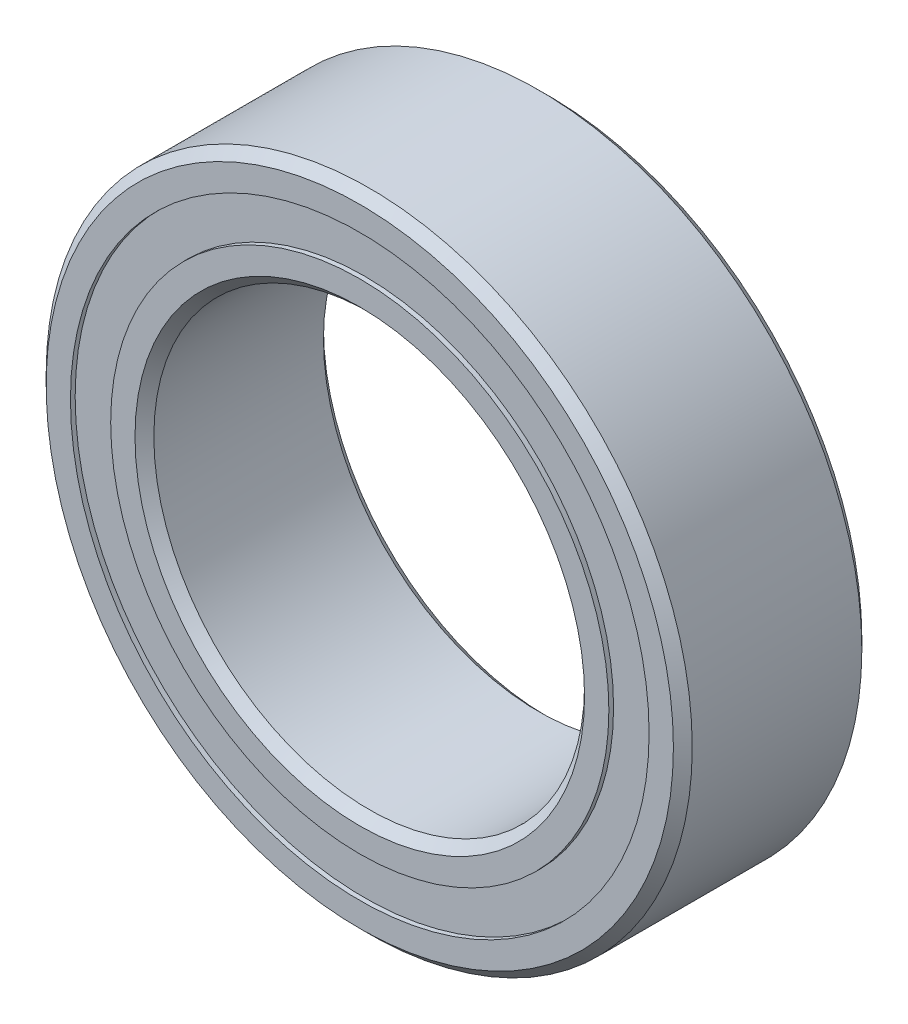
ISO-10303-21;
HEADER;
FILE_DESCRIPTION(('STEP AP214'),'2;1');
FILE_NAME('part.step','',(''),(''),'','','');
FILE_SCHEMA(('AUTOMOTIVE_DESIGN { 1 0 10303 214 1 1 1 1 }'));
ENDSEC;
DATA;
#1=APPLICATION_CONTEXT('core data for automotive mechanical design processes');
#2=APPLICATION_PROTOCOL_DEFINITION('international standard','automotive_design',2000,#1);
#3=PRODUCT_CONTEXT('',#1,'mechanical');
#4=PRODUCT('Part','Part','',(#3));
#5=PRODUCT_RELATED_PRODUCT_CATEGORY('part','',(#4));
#6=PRODUCT_DEFINITION_FORMATION('','',#4);
#7=PRODUCT_DEFINITION_CONTEXT('part definition',#1,'design');
#8=PRODUCT_DEFINITION('design','',#6,#7);
#9=PRODUCT_DEFINITION_SHAPE('','',#8);
#10=(LENGTH_UNIT() NAMED_UNIT(*) SI_UNIT(.MILLI.,.METRE.));
#11=(NAMED_UNIT(*) PLANE_ANGLE_UNIT() SI_UNIT($,.RADIAN.));
#12=(NAMED_UNIT(*) SI_UNIT($,.STERADIAN.) SOLID_ANGLE_UNIT());
#13=UNCERTAINTY_MEASURE_WITH_UNIT(LENGTH_MEASURE(1.E-05),#10,'distance_accuracy_value','');
#14=(GEOMETRIC_REPRESENTATION_CONTEXT(3) GLOBAL_UNCERTAINTY_ASSIGNED_CONTEXT((#13)) GLOBAL_UNIT_ASSIGNED_CONTEXT((#10,
#11,#12)) REPRESENTATION_CONTEXT('',''));
#15=CARTESIAN_POINT('',(0.,0.,0.));
#16=DIRECTION('',(0.,0.,1.));
#17=DIRECTION('',(1.,0.,0.));
#18=AXIS2_PLACEMENT_3D('',#15,#16,#17);
#19=CARTESIAN_POINT('',(0.,5.37362637362637,-1.6625));
#20=DIRECTION('',(0.,0.,1.));
#21=DIRECTION('',(1.,0.,0.));
#22=AXIS2_PLACEMENT_3D('',#19,#20,#21);
#23=PLANE('',#22);
#24=CARTESIAN_POINT('',(0.,0.,-1.6625));
#25=DIRECTION('',(0.,0.,1.));
#26=DIRECTION('',(1.,0.,0.));
#27=AXIS2_PLACEMENT_3D('',#24,#25,#26);
#28=CIRCLE('',#27,5.37362637362637);
#29=CARTESIAN_POINT('',(5.37362637362637,0.,-1.6625));
#30=VERTEX_POINT('',#29);
#31=EDGE_CURVE('E55',#30,#30,#28,.T.);
#32=ORIENTED_EDGE('',*,*,#31,.F.);
#33=EDGE_LOOP('',(#32));
#34=FACE_BOUND('',#33,.T.);
#35=CARTESIAN_POINT('',(0.,0.,-1.6625));
#36=DIRECTION('',(0.,0.,1.));
#37=DIRECTION('',(1.,0.,0.));
#38=AXIS2_PLACEMENT_3D('',#35,#36,#37);
#39=CIRCLE('',#38,4.62637362637363);
#40=CARTESIAN_POINT('',(4.62637362637363,0.,-1.6625));
#41=VERTEX_POINT('',#40);
#42=EDGE_CURVE('E11',#41,#41,#39,.T.);
#43=ORIENTED_EDGE('',*,*,#42,.T.);
#44=EDGE_LOOP('',(#43));
#45=FACE_BOUND('',#44,.T.);
#46=ADVANCED_FACE('F41',(#34,#45),#23,.F.);
#47=CARTESIAN_POINT('',(0.,0.,1.75));
#48=DIRECTION('',(0.,0.,1.));
#49=DIRECTION('',(1.,0.,0.));
#50=AXIS2_PLACEMENT_3D('',#47,#48,#49);
#51=CYLINDRICAL_SURFACE('',#50,4.62637362637363);
#52=ORIENTED_EDGE('',*,*,#42,.F.);
#53=EDGE_LOOP('',(#52));
#54=FACE_BOUND('',#53,.T.);
#55=CARTESIAN_POINT('',(0.,0.,-0.862864380232568));
#56=DIRECTION('',(0.,0.,1.));
#57=DIRECTION('',(1.,0.,0.));
#58=AXIS2_PLACEMENT_3D('',#55,#56,#57);
#59=CIRCLE('',#58,4.62637362637363);
#60=CARTESIAN_POINT('',(4.62637362637363,0.,-0.862864380232568));
#61=VERTEX_POINT('',#60);
#62=EDGE_CURVE('E47',#61,#61,#59,.T.);
#63=ORIENTED_EDGE('',*,*,#62,.T.);
#64=EDGE_LOOP('',(#63));
#65=FACE_BOUND('',#64,.T.);
#66=ADVANCED_FACE('F64',(#54,#65),#51,.F.);
#67=CARTESIAN_POINT('',(0.,5.37362637362637,-0.862864380232568));
#68=DIRECTION('',(0.,0.,-1.));
#69=DIRECTION('',(-1.,0.,0.));
#70=AXIS2_PLACEMENT_3D('',#67,#68,#69);
#71=PLANE('',#70);
#72=ORIENTED_EDGE('',*,*,#62,.F.);
#73=EDGE_LOOP('',(#72));
#74=FACE_BOUND('',#73,.T.);
#75=CARTESIAN_POINT('',(0.,0.,-0.862864380232568));
#76=DIRECTION('',(0.,0.,1.));
#77=DIRECTION('',(1.,0.,0.));
#78=AXIS2_PLACEMENT_3D('',#75,#76,#77);
#79=CIRCLE('',#78,5.37362637362637);
#80=CARTESIAN_POINT('',(5.37362637362637,0.,-0.862864380232568));
#81=VERTEX_POINT('',#80);
#82=EDGE_CURVE('E51',#81,#81,#79,.T.);
#83=ORIENTED_EDGE('',*,*,#82,.T.);
#84=EDGE_LOOP('',(#83));
#85=FACE_BOUND('',#84,.T.);
#86=ADVANCED_FACE('F68',(#74,#85),#71,.F.);
#87=CARTESIAN_POINT('',(0.,0.,1.75));
#88=DIRECTION('',(0.,0.,1.));
#89=DIRECTION('',(1.,0.,0.));
#90=AXIS2_PLACEMENT_3D('',#87,#88,#89);
#91=CYLINDRICAL_SURFACE('',#90,5.37362637362637);
#92=ORIENTED_EDGE('',*,*,#82,.F.);
#93=EDGE_LOOP('',(#92));
#94=FACE_BOUND('',#93,.T.);
#95=ORIENTED_EDGE('',*,*,#31,.T.);
#96=EDGE_LOOP('',(#95));
#97=FACE_BOUND('',#96,.T.);
#98=ADVANCED_FACE('F61',(#94,#97),#91,.T.);
#99=CLOSED_SHELL('',(#46,#66,#86,#98));
#100=MANIFOLD_SOLID_BREP('B2',#99);
#101=CARTESIAN_POINT('',(0.,5.37362637362637,1.6625));
#102=DIRECTION('',(0.,0.,-1.));
#103=DIRECTION('',(-1.,0.,0.));
#104=AXIS2_PLACEMENT_3D('',#101,#102,#103);
#105=PLANE('',#104);
#106=CARTESIAN_POINT('',(0.,0.,1.6625));
#107=DIRECTION('',(0.,0.,1.));
#108=DIRECTION('',(1.,0.,0.));
#109=AXIS2_PLACEMENT_3D('',#106,#107,#108);
#110=CIRCLE('',#109,4.62637362637363);
#111=CARTESIAN_POINT('',(4.62637362637363,0.,1.6625));
#112=VERTEX_POINT('',#111);
#113=EDGE_CURVE('E40',#112,#112,#110,.T.);
#114=ORIENTED_EDGE('',*,*,#113,.F.);
#115=EDGE_LOOP('',(#114));
#116=FACE_BOUND('',#115,.T.);
#117=CARTESIAN_POINT('',(0.,0.,1.6625));
#118=DIRECTION('',(0.,0.,1.));
#119=DIRECTION('',(1.,0.,0.));
#120=AXIS2_PLACEMENT_3D('',#117,#118,#119);
#121=CIRCLE('',#120,5.37362637362637);
#122=CARTESIAN_POINT('',(5.37362637362637,0.,1.6625));
#123=VERTEX_POINT('',#122);
#124=EDGE_CURVE('E122',#123,#123,#121,.T.);
#125=ORIENTED_EDGE('',*,*,#124,.T.);
#126=EDGE_LOOP('',(#125));
#127=FACE_BOUND('',#126,.T.);
#128=ADVANCED_FACE('F108',(#116,#127),#105,.F.);
#129=CARTESIAN_POINT('',(0.,0.,1.75));
#130=DIRECTION('',(0.,0.,1.));
#131=DIRECTION('',(1.,0.,0.));
#132=AXIS2_PLACEMENT_3D('',#129,#130,#131);
#133=CYLINDRICAL_SURFACE('',#132,4.62637362637363);
#134=CARTESIAN_POINT('',(0.,0.,0.862864380232567));
#135=DIRECTION('',(0.,0.,1.));
#136=DIRECTION('',(1.,0.,0.));
#137=AXIS2_PLACEMENT_3D('',#134,#135,#136);
#138=CIRCLE('',#137,4.62637362637363);
#139=CARTESIAN_POINT('',(4.62637362637363,0.,0.862864380232567));
#140=VERTEX_POINT('',#139);
#141=EDGE_CURVE('E114',#140,#140,#138,.T.);
#142=ORIENTED_EDGE('',*,*,#141,.F.);
#143=EDGE_LOOP('',(#142));
#144=FACE_BOUND('',#143,.T.);
#145=ORIENTED_EDGE('',*,*,#113,.T.);
#146=EDGE_LOOP('',(#145));
#147=FACE_BOUND('',#146,.T.);
#148=ADVANCED_FACE('F137',(#144,#147),#133,.F.);
#149=CARTESIAN_POINT('',(0.,5.37362637362637,0.862864380232567));
#150=DIRECTION('',(0.,0.,1.));
#151=DIRECTION('',(1.,0.,0.));
#152=AXIS2_PLACEMENT_3D('',#149,#150,#151);
#153=PLANE('',#152);
#154=CARTESIAN_POINT('',(0.,0.,0.862864380232567));
#155=DIRECTION('',(0.,0.,1.));
#156=DIRECTION('',(1.,0.,0.));
#157=AXIS2_PLACEMENT_3D('',#154,#155,#156);
#158=CIRCLE('',#157,5.37362637362637);
#159=CARTESIAN_POINT('',(5.37362637362637,0.,0.862864380232567));
#160=VERTEX_POINT('',#159);
#161=EDGE_CURVE('E118',#160,#160,#158,.T.);
#162=ORIENTED_EDGE('',*,*,#161,.F.);
#163=EDGE_LOOP('',(#162));
#164=FACE_BOUND('',#163,.T.);
#165=ORIENTED_EDGE('',*,*,#141,.T.);
#166=EDGE_LOOP('',(#165));
#167=FACE_BOUND('',#166,.T.);
#168=ADVANCED_FACE('F132',(#164,#167),#153,.F.);
#169=CARTESIAN_POINT('',(0.,0.,1.75));
#170=DIRECTION('',(0.,0.,1.));
#171=DIRECTION('',(1.,0.,0.));
#172=AXIS2_PLACEMENT_3D('',#169,#170,#171);
#173=CYLINDRICAL_SURFACE('',#172,5.37362637362637);
#174=ORIENTED_EDGE('',*,*,#124,.F.);
#175=EDGE_LOOP('',(#174));
#176=FACE_BOUND('',#175,.T.);
#177=ORIENTED_EDGE('',*,*,#161,.T.);
#178=EDGE_LOOP('',(#177));
#179=FACE_BOUND('',#178,.T.);
#180=ADVANCED_FACE('F129',(#176,#179),#173,.T.);
#181=CLOSED_SHELL('',(#128,#148,#168,#180));
#182=MANIFOLD_SOLID_BREP('B6',#181);
#183=CARTESIAN_POINT('',(-2.49999999999994,4.33012701892223,0.));
#184=DIRECTION('',(0.,0.,1.));
#185=DIRECTION('',(0.499999999999989,-0.866025403784445,0.));
#186=AXIS2_PLACEMENT_3D('',#183,#184,#185);
#187=SPHERICAL_SURFACE('',#186,0.862864380232568);
#188=CARTESIAN_POINT('',(-2.49999999999994,4.33012701892223,0.862864380232567));
#189=VERTEX_POINT('',#188);
#190=VERTEX_LOOP('',#189);
#191=FACE_BOUND('',#190,.T.);
#192=ADVANCED_FACE('F175',(#191),#187,.T.);
#193=CLOSED_SHELL('',(#192));
#194=MANIFOLD_SOLID_BREP('B35',#193);
#195=CARTESIAN_POINT('',(-4.33012701892216,2.50000000000005,0.));
#196=DIRECTION('',(0.,0.,1.));
#197=DIRECTION('',(0.866025403784433,-0.50000000000001,0.));
#198=AXIS2_PLACEMENT_3D('',#195,#196,#197);
#199=SPHERICAL_SURFACE('',#198,0.862864380232568);
#200=CARTESIAN_POINT('',(-4.33012701892216,2.50000000000005,0.862864380232567));
#201=VERTEX_POINT('',#200);
#202=VERTEX_LOOP('',#201);
#203=FACE_BOUND('',#202,.T.);
#204=ADVANCED_FACE('F195',(#203),#199,.T.);
#205=CLOSED_SHELL('',(#204));
#206=MANIFOLD_SOLID_BREP('B104',#205);
#207=CARTESIAN_POINT('',(-5.,0.,0.));
#208=DIRECTION('',(0.,0.,1.));
#209=DIRECTION('',(1.,0.,0.));
#210=AXIS2_PLACEMENT_3D('',#207,#208,#209);
#211=SPHERICAL_SURFACE('',#210,0.862864380232568);
#212=CARTESIAN_POINT('',(-5.,0.,0.862864380232567));
#213=VERTEX_POINT('',#212);
#214=VERTEX_LOOP('',#213);
#215=FACE_BOUND('',#214,.T.);
#216=ADVANCED_FACE('F215',(#215),#211,.T.);
#217=CLOSED_SHELL('',(#216));
#218=MANIFOLD_SOLID_BREP('B171',#217);
#219=CARTESIAN_POINT('',(-4.33012701892222,-2.49999999999996,0.));
#220=DIRECTION('',(0.,0.,1.));
#221=DIRECTION('',(0.866025403784443,0.499999999999992,0.));
#222=AXIS2_PLACEMENT_3D('',#219,#220,#221);
#223=SPHERICAL_SURFACE('',#222,0.862864380232568);
#224=CARTESIAN_POINT('',(-4.33012701892222,-2.49999999999996,0.862864380232567));
#225=VERTEX_POINT('',#224);
#226=VERTEX_LOOP('',#225);
#227=FACE_BOUND('',#226,.T.);
#228=ADVANCED_FACE('F235',(#227),#223,.T.);
#229=CLOSED_SHELL('',(#228));
#230=MANIFOLD_SOLID_BREP('B191',#229);
#231=CARTESIAN_POINT('',(-2.50000000000004,-4.33012701892217,0.));
#232=DIRECTION('',(0.,0.,1.));
#233=DIRECTION('',(0.500000000000007,0.866025403784435,0.));
#234=AXIS2_PLACEMENT_3D('',#231,#232,#233);
#235=SPHERICAL_SURFACE('',#234,0.862864380232568);
#236=CARTESIAN_POINT('',(-2.50000000000004,-4.33012701892217,0.862864380232567));
#237=VERTEX_POINT('',#236);
#238=VERTEX_LOOP('',#237);
#239=FACE_BOUND('',#238,.T.);
#240=ADVANCED_FACE('F255',(#239),#235,.T.);
#241=CLOSED_SHELL('',(#240));
#242=MANIFOLD_SOLID_BREP('B211',#241);
#243=CARTESIAN_POINT('',(0.,-5.,0.));
#244=DIRECTION('',(0.,0.,1.));
#245=DIRECTION('',(0.,1.,0.));
#246=AXIS2_PLACEMENT_3D('',#243,#244,#245);
#247=SPHERICAL_SURFACE('',#246,0.862864380232568);
#248=CARTESIAN_POINT('',(0.,-5.,0.862864380232567));
#249=VERTEX_POINT('',#248);
#250=VERTEX_LOOP('',#249);
#251=FACE_BOUND('',#250,.T.);
#252=ADVANCED_FACE('F275',(#251),#247,.T.);
#253=CLOSED_SHELL('',(#252));
#254=MANIFOLD_SOLID_BREP('B231',#253);
#255=CARTESIAN_POINT('',(2.49999999999997,-4.33012701892221,0.));
#256=DIRECTION('',(0.,0.,1.));
#257=DIRECTION('',(-0.499999999999995,0.866025403784442,0.));
#258=AXIS2_PLACEMENT_3D('',#255,#256,#257);
#259=SPHERICAL_SURFACE('',#258,0.862864380232568);
#260=CARTESIAN_POINT('',(2.49999999999997,-4.33012701892221,0.862864380232567));
#261=VERTEX_POINT('',#260);
#262=VERTEX_LOOP('',#261);
#263=FACE_BOUND('',#262,.T.);
#264=ADVANCED_FACE('F295',(#263),#259,.T.);
#265=CLOSED_SHELL('',(#264));
#266=MANIFOLD_SOLID_BREP('B251',#265);
#267=CARTESIAN_POINT('',(4.33012701892218,-2.50000000000002,0.));
#268=DIRECTION('',(0.,0.,1.));
#269=DIRECTION('',(-0.866025403784436,0.500000000000004,0.));
#270=AXIS2_PLACEMENT_3D('',#267,#268,#269);
#271=SPHERICAL_SURFACE('',#270,0.862864380232568);
#272=CARTESIAN_POINT('',(4.33012701892218,-2.50000000000002,0.862864380232567));
#273=VERTEX_POINT('',#272);
#274=VERTEX_LOOP('',#273);
#275=FACE_BOUND('',#274,.T.);
#276=ADVANCED_FACE('F315',(#275),#271,.T.);
#277=CLOSED_SHELL('',(#276));
#278=MANIFOLD_SOLID_BREP('B271',#277);
#279=CARTESIAN_POINT('',(5.,0.,0.));
#280=DIRECTION('',(0.,0.,1.));
#281=DIRECTION('',(-1.,0.,0.));
#282=AXIS2_PLACEMENT_3D('',#279,#280,#281);
#283=SPHERICAL_SURFACE('',#282,0.862864380232568);
#284=CARTESIAN_POINT('',(5.,0.,0.862864380232567));
#285=VERTEX_POINT('',#284);
#286=VERTEX_LOOP('',#285);
#287=FACE_BOUND('',#286,.T.);
#288=ADVANCED_FACE('F335',(#287),#283,.T.);
#289=CLOSED_SHELL('',(#288));
#290=MANIFOLD_SOLID_BREP('B291',#289);
#291=CARTESIAN_POINT('',(4.3301270189222,2.49999999999999,0.));
#292=DIRECTION('',(0.,0.,1.));
#293=DIRECTION('',(-0.86602540378444,-0.499999999999998,0.));
#294=AXIS2_PLACEMENT_3D('',#291,#292,#293);
#295=SPHERICAL_SURFACE('',#294,0.862864380232568);
#296=CARTESIAN_POINT('',(4.3301270189222,2.49999999999999,0.862864380232567));
#297=VERTEX_POINT('',#296);
#298=VERTEX_LOOP('',#297);
#299=FACE_BOUND('',#298,.T.);
#300=ADVANCED_FACE('F355',(#299),#295,.T.);
#301=CLOSED_SHELL('',(#300));
#302=MANIFOLD_SOLID_BREP('B311',#301);
#303=CARTESIAN_POINT('',(2.50000000000001,4.33012701892219,0.));
#304=DIRECTION('',(0.,0.,1.));
#305=DIRECTION('',(-0.500000000000001,-0.866025403784438,0.));
#306=AXIS2_PLACEMENT_3D('',#303,#304,#305);
#307=SPHERICAL_SURFACE('',#306,0.862864380232568);
#308=CARTESIAN_POINT('',(2.50000000000001,4.33012701892219,0.862864380232567));
#309=VERTEX_POINT('',#308);
#310=VERTEX_LOOP('',#309);
#311=FACE_BOUND('',#310,.T.);
#312=ADVANCED_FACE('F375',(#311),#307,.T.);
#313=CLOSED_SHELL('',(#312));
#314=MANIFOLD_SOLID_BREP('B331',#313);
#315=CARTESIAN_POINT('',(0.,5.,0.));
#316=DIRECTION('',(0.,0.,1.));
#317=DIRECTION('',(0.,-1.,0.));
#318=AXIS2_PLACEMENT_3D('',#315,#316,#317);
#319=SPHERICAL_SURFACE('',#318,0.862864380232568);
#320=CARTESIAN_POINT('',(0.,5.,0.862864380232567));
#321=VERTEX_POINT('',#320);
#322=VERTEX_LOOP('',#321);
#323=FACE_BOUND('',#322,.T.);
#324=ADVANCED_FACE('F397',(#323),#319,.T.);
#325=CLOSED_SHELL('',(#324));
#326=MANIFOLD_SOLID_BREP('B351',#325);
#327=CARTESIAN_POINT('',(0.,4.62637362637363,1.75));
#328=DIRECTION('',(0.,0.,-1.));
#329=DIRECTION('',(-1.,0.,0.));
#330=AXIS2_PLACEMENT_3D('',#327,#328,#329);
#331=PLANE('',#330);
#332=CARTESIAN_POINT('',(0.,0.,1.75));
#333=DIRECTION('',(0.,0.,1.));
#334=DIRECTION('',(1.,0.,0.));
#335=AXIS2_PLACEMENT_3D('',#332,#333,#334);
#336=CIRCLE('',#335,4.175);
#337=CARTESIAN_POINT('',(4.175,0.,1.75));
#338=VERTEX_POINT('',#337);
#339=EDGE_CURVE('E444',#338,#338,#336,.T.);
#340=ORIENTED_EDGE('',*,*,#339,.F.);
#341=EDGE_LOOP('',(#340));
#342=FACE_BOUND('',#341,.T.);
#343=CARTESIAN_POINT('',(0.,0.,1.75));
#344=DIRECTION('',(0.,0.,1.));
#345=DIRECTION('',(1.,0.,0.));
#346=AXIS2_PLACEMENT_3D('',#343,#344,#345);
#347=CIRCLE('',#346,4.62637362637363);
#348=CARTESIAN_POINT('',(4.62637362637363,0.,1.75));
#349=VERTEX_POINT('',#348);
#350=EDGE_CURVE('E396',#349,#349,#347,.T.);
#351=ORIENTED_EDGE('',*,*,#350,.T.);
#352=EDGE_LOOP('',(#351));
#353=FACE_BOUND('',#352,.T.);
#354=ADVANCED_FACE('F416',(#342,#353),#331,.F.);
#355=CARTESIAN_POINT('',(0.,0.,1.75));
#356=DIRECTION('',(0.,0.,1.));
#357=DIRECTION('',(1.,0.,0.));
#358=AXIS2_PLACEMENT_3D('',#355,#356,#357);
#359=CYLINDRICAL_SURFACE('',#358,4.62637362637363);
#360=ORIENTED_EDGE('',*,*,#350,.F.);
#361=EDGE_LOOP('',(#360));
#362=FACE_BOUND('',#361,.T.);
#363=CARTESIAN_POINT('',(0.,0.,0.777777777777777));
#364=DIRECTION('',(0.,0.,1.));
#365=DIRECTION('',(1.,0.,0.));
#366=AXIS2_PLACEMENT_3D('',#363,#364,#365);
#367=CIRCLE('',#366,4.62637362637363);
#368=CARTESIAN_POINT('',(4.62637362637363,0.,0.777777777777777));
#369=VERTEX_POINT('',#368);
#370=EDGE_CURVE('E422',#369,#369,#367,.T.);
#371=ORIENTED_EDGE('',*,*,#370,.T.);
#372=EDGE_LOOP('',(#371));
#373=FACE_BOUND('',#372,.T.);
#374=ADVANCED_FACE('F451',(#362,#373),#359,.T.);
#375=CARTESIAN_POINT('',(0.,0.,0.));
#376=DIRECTION('',(0.,0.,1.));
#377=DIRECTION('',(1.,0.,0.));
#378=AXIS2_PLACEMENT_3D('',#375,#376,#377);
#379=TOROIDAL_SURFACE('',#378,5.,0.862864380232566);
#380=ORIENTED_EDGE('',*,*,#370,.F.);
#381=EDGE_LOOP('',(#380));
#382=FACE_BOUND('',#381,.T.);
#383=CARTESIAN_POINT('',(0.,0.,-0.777777777777779));
#384=DIRECTION('',(0.,0.,1.));
#385=DIRECTION('',(1.,0.,0.));
#386=AXIS2_PLACEMENT_3D('',#383,#384,#385);
#387=CIRCLE('',#386,4.62637362637362);
#388=CARTESIAN_POINT('',(4.62637362637362,0.,-0.777777777777779));
#389=VERTEX_POINT('',#388);
#390=EDGE_CURVE('E426',#389,#389,#387,.T.);
#391=ORIENTED_EDGE('',*,*,#390,.T.);
#392=EDGE_LOOP('',(#391));
#393=FACE_BOUND('',#392,.T.);
#394=ADVANCED_FACE('F455',(#382,#393),#379,.F.);
#395=CARTESIAN_POINT('',(0.,0.,1.75));
#396=DIRECTION('',(0.,0.,1.));
#397=DIRECTION('',(1.,0.,0.));
#398=AXIS2_PLACEMENT_3D('',#395,#396,#397);
#399=CYLINDRICAL_SURFACE('',#398,4.62637362637362);
#400=ORIENTED_EDGE('',*,*,#390,.F.);
#401=EDGE_LOOP('',(#400));
#402=FACE_BOUND('',#401,.T.);
#403=CARTESIAN_POINT('',(0.,0.,-1.75));
#404=DIRECTION('',(0.,0.,1.));
#405=DIRECTION('',(1.,0.,0.));
#406=AXIS2_PLACEMENT_3D('',#403,#404,#405);
#407=CIRCLE('',#406,4.62637362637363);
#408=CARTESIAN_POINT('',(4.62637362637363,0.,-1.75));
#409=VERTEX_POINT('',#408);
#410=EDGE_CURVE('E430',#409,#409,#407,.T.);
#411=ORIENTED_EDGE('',*,*,#410,.T.);
#412=EDGE_LOOP('',(#411));
#413=FACE_BOUND('',#412,.T.);
#414=ADVANCED_FACE('F460',(#402,#413),#399,.T.);
#415=CARTESIAN_POINT('',(0.,4.175,-1.75));
#416=DIRECTION('',(0.,0.,1.));
#417=DIRECTION('',(1.,0.,0.));
#418=AXIS2_PLACEMENT_3D('',#415,#416,#417);
#419=PLANE('',#418);
#420=ORIENTED_EDGE('',*,*,#410,.F.);
#421=EDGE_LOOP('',(#420));
#422=FACE_BOUND('',#421,.T.);
#423=CARTESIAN_POINT('',(0.,0.,-1.75));
#424=DIRECTION('',(0.,0.,1.));
#425=DIRECTION('',(1.,0.,0.));
#426=AXIS2_PLACEMENT_3D('',#423,#424,#425);
#427=CIRCLE('',#426,4.175);
#428=CARTESIAN_POINT('',(4.175,0.,-1.75));
#429=VERTEX_POINT('',#428);
#430=EDGE_CURVE('E435',#429,#429,#427,.T.);
#431=ORIENTED_EDGE('',*,*,#430,.T.);
#432=EDGE_LOOP('',(#431));
#433=FACE_BOUND('',#432,.T.);
#434=ADVANCED_FACE('F466',(#422,#433),#419,.F.);
#435=CARTESIAN_POINT('',(0.,0.,-1.575));
#436=DIRECTION('',(0.,0.,-1.));
#437=DIRECTION('',(-1.,0.,0.));
#438=AXIS2_PLACEMENT_3D('',#435,#436,#437);
#439=CONICAL_SURFACE('',#438,4.,0.785398163397448);
#440=ORIENTED_EDGE('',*,*,#430,.F.);
#441=EDGE_LOOP('',(#440));
#442=FACE_BOUND('',#441,.T.);
#443=CARTESIAN_POINT('',(0.,0.,-1.575));
#444=DIRECTION('',(0.,0.,1.));
#445=DIRECTION('',(1.,0.,0.));
#446=AXIS2_PLACEMENT_3D('',#443,#444,#445);
#447=CIRCLE('',#446,4.);
#448=CARTESIAN_POINT('',(4.,0.,-1.575));
#449=VERTEX_POINT('',#448);
#450=EDGE_CURVE('E438',#449,#449,#447,.T.);
#451=ORIENTED_EDGE('',*,*,#450,.T.);
#452=EDGE_LOOP('',(#451));
#453=FACE_BOUND('',#452,.T.);
#454=ADVANCED_FACE('F470',(#442,#453),#439,.F.);
#455=CARTESIAN_POINT('',(0.,0.,1.75));
#456=DIRECTION('',(0.,0.,1.));
#457=DIRECTION('',(1.,0.,0.));
#458=AXIS2_PLACEMENT_3D('',#455,#456,#457);
#459=CYLINDRICAL_SURFACE('',#458,4.);
#460=ORIENTED_EDGE('',*,*,#450,.F.);
#461=EDGE_LOOP('',(#460));
#462=FACE_BOUND('',#461,.T.);
#463=CARTESIAN_POINT('',(0.,0.,1.575));
#464=DIRECTION('',(0.,0.,1.));
#465=DIRECTION('',(1.,0.,0.));
#466=AXIS2_PLACEMENT_3D('',#463,#464,#465);
#467=CIRCLE('',#466,4.);
#468=CARTESIAN_POINT('',(4.,0.,1.575));
#469=VERTEX_POINT('',#468);
#470=EDGE_CURVE('E441',#469,#469,#467,.T.);
#471=ORIENTED_EDGE('',*,*,#470,.T.);
#472=EDGE_LOOP('',(#471));
#473=FACE_BOUND('',#472,.T.);
#474=ADVANCED_FACE('F474',(#462,#473),#459,.F.);
#475=CARTESIAN_POINT('',(0.,0.,1.75));
#476=DIRECTION('',(0.,0.,1.));
#477=DIRECTION('',(1.,0.,0.));
#478=AXIS2_PLACEMENT_3D('',#475,#476,#477);
#479=CONICAL_SURFACE('',#478,4.175,0.785398163397447);
#480=ORIENTED_EDGE('',*,*,#470,.F.);
#481=EDGE_LOOP('',(#480));
#482=FACE_BOUND('',#481,.T.);
#483=ORIENTED_EDGE('',*,*,#339,.T.);
#484=EDGE_LOOP('',(#483));
#485=FACE_BOUND('',#484,.T.);
#486=ADVANCED_FACE('F448',(#482,#485),#479,.F.);
#487=CLOSED_SHELL('',(#354,#374,#394,#414,#434,#454,#474,#486));
#488=MANIFOLD_SOLID_BREP('B371',#487);
#489=CARTESIAN_POINT('',(0.,0.,1.575));
#490=DIRECTION('',(0.,0.,-1.));
#491=DIRECTION('',(-1.,0.,0.));
#492=AXIS2_PLACEMENT_3D('',#489,#490,#491);
#493=CONICAL_SURFACE('',#492,6.,0.78539816339745);
#494=CARTESIAN_POINT('',(0.,0.,1.75));
#495=DIRECTION('',(0.,0.,1.));
#496=DIRECTION('',(1.,0.,0.));
#497=AXIS2_PLACEMENT_3D('',#494,#495,#496);
#498=CIRCLE('',#497,5.825);
#499=CARTESIAN_POINT('',(5.825,0.,1.75));
#500=VERTEX_POINT('',#499);
#501=EDGE_CURVE('E565',#500,#500,#498,.T.);
#502=ORIENTED_EDGE('',*,*,#501,.F.);
#503=EDGE_LOOP('',(#502));
#504=FACE_BOUND('',#503,.T.);
#505=CARTESIAN_POINT('',(0.,0.,1.575));
#506=DIRECTION('',(0.,0.,1.));
#507=DIRECTION('',(1.,0.,0.));
#508=AXIS2_PLACEMENT_3D('',#505,#506,#507);
#509=CIRCLE('',#508,6.);
#510=CARTESIAN_POINT('',(6.,0.,1.575));
#511=VERTEX_POINT('',#510);
#512=EDGE_CURVE('E415',#511,#511,#509,.T.);
#513=ORIENTED_EDGE('',*,*,#512,.T.);
#514=EDGE_LOOP('',(#513));
#515=FACE_BOUND('',#514,.T.);
#516=ADVANCED_FACE('F537',(#504,#515),#493,.T.);
#517=CARTESIAN_POINT('',(0.,0.,1.75));
#518=DIRECTION('',(0.,0.,1.));
#519=DIRECTION('',(1.,0.,0.));
#520=AXIS2_PLACEMENT_3D('',#517,#518,#519);
#521=CYLINDRICAL_SURFACE('',#520,6.);
#522=ORIENTED_EDGE('',*,*,#512,.F.);
#523=EDGE_LOOP('',(#522));
#524=FACE_BOUND('',#523,.T.);
#525=CARTESIAN_POINT('',(0.,0.,-1.575));
#526=DIRECTION('',(0.,0.,1.));
#527=DIRECTION('',(1.,0.,0.));
#528=AXIS2_PLACEMENT_3D('',#525,#526,#527);
#529=CIRCLE('',#528,6.);
#530=CARTESIAN_POINT('',(6.,0.,-1.575));
#531=VERTEX_POINT('',#530);
#532=EDGE_CURVE('E543',#531,#531,#529,.T.);
#533=ORIENTED_EDGE('',*,*,#532,.T.);
#534=EDGE_LOOP('',(#533));
#535=FACE_BOUND('',#534,.T.);
#536=ADVANCED_FACE('F572',(#524,#535),#521,.T.);
#537=CARTESIAN_POINT('',(0.,0.,-1.75));
#538=DIRECTION('',(0.,0.,1.));
#539=DIRECTION('',(1.,0.,0.));
#540=AXIS2_PLACEMENT_3D('',#537,#538,#539);
#541=CONICAL_SURFACE('',#540,5.825,0.78539816339745);
#542=ORIENTED_EDGE('',*,*,#532,.F.);
#543=EDGE_LOOP('',(#542));
#544=FACE_BOUND('',#543,.T.);
#545=CARTESIAN_POINT('',(0.,0.,-1.75));
#546=DIRECTION('',(0.,0.,1.));
#547=DIRECTION('',(1.,0.,0.));
#548=AXIS2_PLACEMENT_3D('',#545,#546,#547);
#549=CIRCLE('',#548,5.825);
#550=CARTESIAN_POINT('',(5.825,0.,-1.75));
#551=VERTEX_POINT('',#550);
#552=EDGE_CURVE('E547',#551,#551,#549,.T.);
#553=ORIENTED_EDGE('',*,*,#552,.T.);
#554=EDGE_LOOP('',(#553));
#555=FACE_BOUND('',#554,.T.);
#556=ADVANCED_FACE('F576',(#544,#555),#541,.T.);
#557=CARTESIAN_POINT('',(0.,5.825,-1.75));
#558=DIRECTION('',(0.,0.,1.));
#559=DIRECTION('',(1.,0.,0.));
#560=AXIS2_PLACEMENT_3D('',#557,#558,#559);
#561=PLANE('',#560);
#562=ORIENTED_EDGE('',*,*,#552,.F.);
#563=EDGE_LOOP('',(#562));
#564=FACE_BOUND('',#563,.T.);
#565=CARTESIAN_POINT('',(0.,0.,-1.75));
#566=DIRECTION('',(0.,0.,1.));
#567=DIRECTION('',(1.,0.,0.));
#568=AXIS2_PLACEMENT_3D('',#565,#566,#567);
#569=CIRCLE('',#568,5.37362637362637);
#570=CARTESIAN_POINT('',(5.37362637362637,0.,-1.75));
#571=VERTEX_POINT('',#570);
#572=EDGE_CURVE('E551',#571,#571,#569,.T.);
#573=ORIENTED_EDGE('',*,*,#572,.T.);
#574=EDGE_LOOP('',(#573));
#575=FACE_BOUND('',#574,.T.);
#576=ADVANCED_FACE('F581',(#564,#575),#561,.F.);
#577=CARTESIAN_POINT('',(0.,0.,1.75));
#578=DIRECTION('',(0.,0.,1.));
#579=DIRECTION('',(1.,0.,0.));
#580=AXIS2_PLACEMENT_3D('',#577,#578,#579);
#581=CYLINDRICAL_SURFACE('',#580,5.37362637362637);
#582=ORIENTED_EDGE('',*,*,#572,.F.);
#583=EDGE_LOOP('',(#582));
#584=FACE_BOUND('',#583,.T.);
#585=CARTESIAN_POINT('',(0.,0.,-0.777777777777778));
#586=DIRECTION('',(0.,0.,1.));
#587=DIRECTION('',(1.,0.,0.));
#588=AXIS2_PLACEMENT_3D('',#585,#586,#587);
#589=CIRCLE('',#588,5.37362637362637);
#590=CARTESIAN_POINT('',(5.37362637362637,0.,-0.777777777777778));
#591=VERTEX_POINT('',#590);
#592=EDGE_CURVE('E556',#591,#591,#589,.T.);
#593=ORIENTED_EDGE('',*,*,#592,.T.);
#594=EDGE_LOOP('',(#593));
#595=FACE_BOUND('',#594,.T.);
#596=ADVANCED_FACE('F587',(#584,#595),#581,.F.);
#597=CARTESIAN_POINT('',(0.,0.,0.));
#598=DIRECTION('',(0.,0.,1.));
#599=DIRECTION('',(1.,0.,0.));
#600=AXIS2_PLACEMENT_3D('',#597,#598,#599);
#601=TOROIDAL_SURFACE('',#600,5.,0.862864380232568);
#602=ORIENTED_EDGE('',*,*,#592,.F.);
#603=EDGE_LOOP('',(#602));
#604=FACE_BOUND('',#603,.T.);
#605=CARTESIAN_POINT('',(0.,0.,0.777777777777777));
#606=DIRECTION('',(0.,0.,1.));
#607=DIRECTION('',(1.,0.,0.));
#608=AXIS2_PLACEMENT_3D('',#605,#606,#607);
#609=CIRCLE('',#608,5.37362637362637);
#610=CARTESIAN_POINT('',(5.37362637362637,0.,0.777777777777777));
#611=VERTEX_POINT('',#610);
#612=EDGE_CURVE('E559',#611,#611,#609,.T.);
#613=ORIENTED_EDGE('',*,*,#612,.T.);
#614=EDGE_LOOP('',(#613));
#615=FACE_BOUND('',#614,.T.);
#616=ADVANCED_FACE('F591',(#604,#615),#601,.F.);
#617=CARTESIAN_POINT('',(0.,0.,1.75));
#618=DIRECTION('',(0.,0.,1.));
#619=DIRECTION('',(1.,0.,0.));
#620=AXIS2_PLACEMENT_3D('',#617,#618,#619);
#621=CYLINDRICAL_SURFACE('',#620,5.37362637362637);
#622=ORIENTED_EDGE('',*,*,#612,.F.);
#623=EDGE_LOOP('',(#622));
#624=FACE_BOUND('',#623,.T.);
#625=CARTESIAN_POINT('',(0.,0.,1.75));
#626=DIRECTION('',(0.,0.,1.));
#627=DIRECTION('',(1.,0.,0.));
#628=AXIS2_PLACEMENT_3D('',#625,#626,#627);
#629=CIRCLE('',#628,5.37362637362637);
#630=CARTESIAN_POINT('',(5.37362637362637,0.,1.75));
#631=VERTEX_POINT('',#630);
#632=EDGE_CURVE('E562',#631,#631,#629,.T.);
#633=ORIENTED_EDGE('',*,*,#632,.T.);
#634=EDGE_LOOP('',(#633));
#635=FACE_BOUND('',#634,.T.);
#636=ADVANCED_FACE('F595',(#624,#635),#621,.F.);
#637=CARTESIAN_POINT('',(0.,5.825,1.75));
#638=DIRECTION('',(0.,0.,-1.));
#639=DIRECTION('',(-1.,0.,0.));
#640=AXIS2_PLACEMENT_3D('',#637,#638,#639);
#641=PLANE('',#640);
#642=ORIENTED_EDGE('',*,*,#632,.F.);
#643=EDGE_LOOP('',(#642));
#644=FACE_BOUND('',#643,.T.);
#645=ORIENTED_EDGE('',*,*,#501,.T.);
#646=EDGE_LOOP('',(#645));
#647=FACE_BOUND('',#646,.T.);
#648=ADVANCED_FACE('F569',(#644,#647),#641,.F.);
#649=CLOSED_SHELL('',(#516,#536,#556,#576,#596,#616,#636,#648));
#650=MANIFOLD_SOLID_BREP('B391',#649);
#651=ADVANCED_BREP_SHAPE_REPRESENTATION('',(#18,#100,#182,#194,#206,#218,#230,#242,#254,#266,
#278,#290,#302,#314,#326,#488,#650),#14);
#652=SHAPE_DEFINITION_REPRESENTATION(#9,#651);
ENDSEC;
END-ISO-10303-21;
